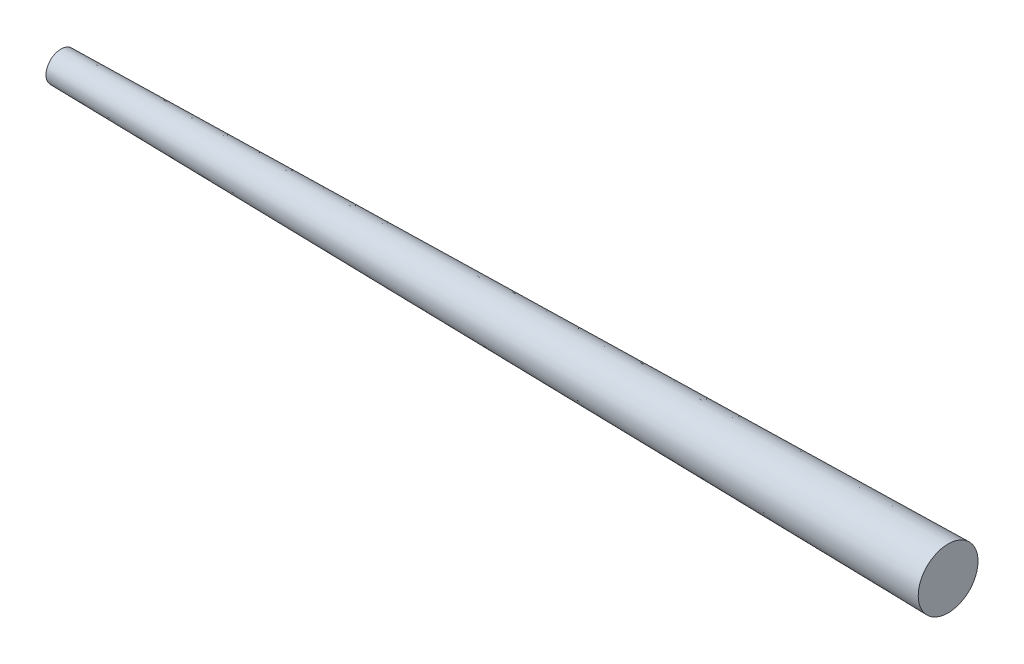
ISO-10303-21;
HEADER;
FILE_DESCRIPTION(('STEP AP214'),'2;1');
FILE_NAME('part.step','',(''),(''),'','','');
FILE_SCHEMA(('AUTOMOTIVE_DESIGN { 1 0 10303 214 1 1 1 1 }'));
ENDSEC;
DATA;
#1=APPLICATION_CONTEXT('core data for automotive mechanical design processes');
#2=APPLICATION_PROTOCOL_DEFINITION('international standard','automotive_design',2000,#1);
#3=PRODUCT_CONTEXT('',#1,'mechanical');
#4=PRODUCT('Part','Part','',(#3));
#5=PRODUCT_RELATED_PRODUCT_CATEGORY('part','',(#4));
#6=PRODUCT_DEFINITION_FORMATION('','',#4);
#7=PRODUCT_DEFINITION_CONTEXT('part definition',#1,'design');
#8=PRODUCT_DEFINITION('design','',#6,#7);
#9=PRODUCT_DEFINITION_SHAPE('','',#8);
#10=(LENGTH_UNIT() NAMED_UNIT(*) SI_UNIT(.MILLI.,.METRE.));
#11=(NAMED_UNIT(*) PLANE_ANGLE_UNIT() SI_UNIT($,.RADIAN.));
#12=(NAMED_UNIT(*) SI_UNIT($,.STERADIAN.) SOLID_ANGLE_UNIT());
#13=UNCERTAINTY_MEASURE_WITH_UNIT(LENGTH_MEASURE(1.E-05),#10,'distance_accuracy_value','');
#14=(GEOMETRIC_REPRESENTATION_CONTEXT(3) GLOBAL_UNCERTAINTY_ASSIGNED_CONTEXT((#13)) GLOBAL_UNIT_ASSIGNED_CONTEXT((#10,
#11,#12)) REPRESENTATION_CONTEXT('',''));
#15=CARTESIAN_POINT('',(0.,0.,0.));
#16=DIRECTION('',(0.,0.,1.));
#17=DIRECTION('',(1.,0.,0.));
#18=AXIS2_PLACEMENT_3D('',#15,#16,#17);
#19=CARTESIAN_POINT('',(-5.5634448223734,0.,0.));
#20=DIRECTION('',(-1.,0.,0.));
#21=DIRECTION('',(0.,-1.,0.));
#22=AXIS2_PLACEMENT_3D('',#19,#20,#21);
#23=PLANE('',#22);
#24=CARTESIAN_POINT('',(-5.56344482237339,0.,0.));
#25=DIRECTION('',(1.,0.,0.));
#26=DIRECTION('',(0.,1.,0.));
#27=AXIS2_PLACEMENT_3D('',#24,#25,#26);
#28=CIRCLE('',#27,1.5);
#29=CARTESIAN_POINT('',(-5.56344482237339,1.5,0.));
#30=VERTEX_POINT('',#29);
#31=EDGE_CURVE('E10',#30,#30,#28,.T.);
#32=ORIENTED_EDGE('',*,*,#31,.F.);
#33=EDGE_LOOP('',(#32));
#34=FACE_BOUND('',#33,.T.);
#35=ADVANCED_FACE('F31',(#34),#23,.T.);
#36=CARTESIAN_POINT('',(83.4365551776266,0.,0.));
#37=DIRECTION('',(1.,0.,0.));
#38=DIRECTION('',(0.,1.,0.));
#39=AXIS2_PLACEMENT_3D('',#36,#37,#38);
#40=CONICAL_SURFACE('',#39,3.,0.0168523370413426);
#41=ORIENTED_EDGE('',*,*,#31,.T.);
#42=EDGE_LOOP('',(#41));
#43=FACE_BOUND('',#42,.T.);
#44=CARTESIAN_POINT('',(83.4365551776266,0.,0.));
#45=DIRECTION('',(1.,0.,0.));
#46=DIRECTION('',(0.,1.,0.));
#47=AXIS2_PLACEMENT_3D('',#44,#45,#46);
#48=CIRCLE('',#47,3.);
#49=CARTESIAN_POINT('',(83.4365551776266,3.00000000000001,0.));
#50=VERTEX_POINT('',#49);
#51=EDGE_CURVE('E37',#50,#50,#48,.T.);
#52=ORIENTED_EDGE('',*,*,#51,.F.);
#53=EDGE_LOOP('',(#52));
#54=FACE_BOUND('',#53,.T.);
#55=ADVANCED_FACE('F45',(#43,#54),#40,.T.);
#56=CARTESIAN_POINT('',(83.4365551776266,3.00000000000001,0.));
#57=DIRECTION('',(1.,0.,0.));
#58=DIRECTION('',(0.,1.,0.));
#59=AXIS2_PLACEMENT_3D('',#56,#57,#58);
#60=PLANE('',#59);
#61=ORIENTED_EDGE('',*,*,#51,.T.);
#62=EDGE_LOOP('',(#61));
#63=FACE_BOUND('',#62,.T.);
#64=ADVANCED_FACE('F43',(#63),#60,.T.);
#65=CLOSED_SHELL('',(#35,#55,#64));
#66=MANIFOLD_SOLID_BREP('B2',#65);
#67=ADVANCED_BREP_SHAPE_REPRESENTATION('',(#18,#66),#14);
#68=SHAPE_DEFINITION_REPRESENTATION(#9,#67);
ENDSEC;
END-ISO-10303-21;
